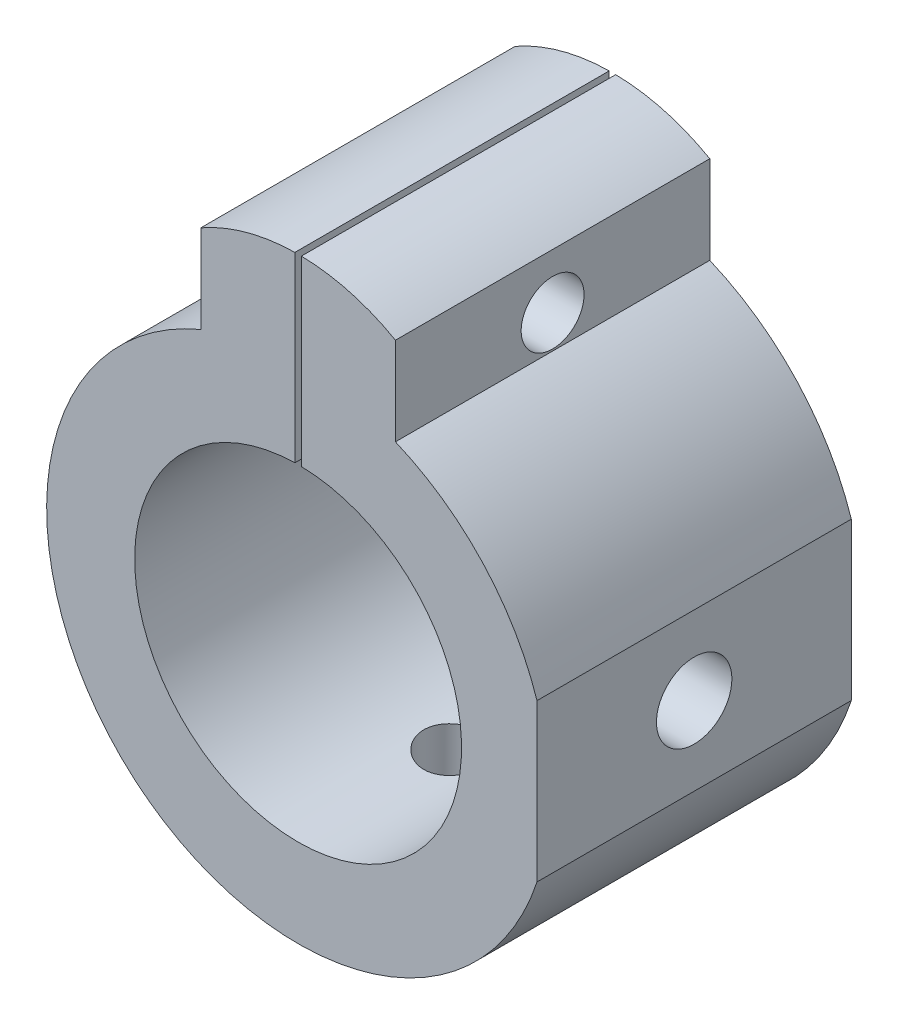
ISO-10303-21;
HEADER;
FILE_DESCRIPTION(('STEP AP214'),'2;1');
FILE_NAME('part.step','',(''),(''),'','','');
FILE_SCHEMA(('AUTOMOTIVE_DESIGN { 1 0 10303 214 1 1 1 1 }'));
ENDSEC;
DATA;
#1=APPLICATION_CONTEXT('core data for automotive mechanical design processes');
#2=APPLICATION_PROTOCOL_DEFINITION('international standard','automotive_design',2000,#1);
#3=PRODUCT_CONTEXT('',#1,'mechanical');
#4=PRODUCT('Part','Part','',(#3));
#5=PRODUCT_RELATED_PRODUCT_CATEGORY('part','',(#4));
#6=PRODUCT_DEFINITION_FORMATION('','',#4);
#7=PRODUCT_DEFINITION_CONTEXT('part definition',#1,'design');
#8=PRODUCT_DEFINITION('design','',#6,#7);
#9=PRODUCT_DEFINITION_SHAPE('','',#8);
#10=(LENGTH_UNIT() NAMED_UNIT(*) SI_UNIT(.MILLI.,.METRE.));
#11=(NAMED_UNIT(*) PLANE_ANGLE_UNIT() SI_UNIT($,.RADIAN.));
#12=(NAMED_UNIT(*) SI_UNIT($,.STERADIAN.) SOLID_ANGLE_UNIT());
#13=UNCERTAINTY_MEASURE_WITH_UNIT(LENGTH_MEASURE(1.E-05),#10,'distance_accuracy_value','');
#14=(GEOMETRIC_REPRESENTATION_CONTEXT(3) GLOBAL_UNCERTAINTY_ASSIGNED_CONTEXT((#13)) GLOBAL_UNIT_ASSIGNED_CONTEXT((#10,
#11,#12)) REPRESENTATION_CONTEXT('',''));
#15=CARTESIAN_POINT('',(0.,0.,0.));
#16=DIRECTION('',(0.,0.,1.));
#17=DIRECTION('',(1.,0.,0.));
#18=AXIS2_PLACEMENT_3D('',#15,#16,#17);
#19=CARTESIAN_POINT('',(0.,0.,10.));
#20=DIRECTION('',(0.,0.,-1.));
#21=DIRECTION('',(-1.,0.,0.));
#22=AXIS2_PLACEMENT_3D('',#19,#20,#21);
#23=CYLINDRICAL_SURFACE('',#22,20.);
#24=CARTESIAN_POINT('',(0.,-20.,15.));
#25=CARTESIAN_POINT('',(0.139841095555761,-19.9999980489643,14.9999940590643));
#26=CARTESIAN_POINT('',(0.279769574302747,-19.998517845549,14.9882271208307));
#27=CARTESIAN_POINT('',(0.555732802089753,-19.9927554011136,14.9414722454292));
#28=CARTESIAN_POINT('',(0.691763330623745,-19.9884702344143,14.9064600620766));
#29=CARTESIAN_POINT('',(0.955895574813054,-19.9775806104441,14.8142623560859));
#30=CARTESIAN_POINT('',(1.08400256014614,-19.9709777145554,14.7570917581901));
#31=CARTESIAN_POINT('',(1.32877947489304,-19.956187008781,14.6222327160302));
#32=CARTESIAN_POINT('',(1.44545136155637,-19.9479994708412,14.5445477914693));
#33=CARTESIAN_POINT('',(1.66471281693132,-19.9309032130633,14.3704080501604));
#34=CARTESIAN_POINT('',(1.76723036493713,-19.9219911469242,14.2738628706538));
#35=CARTESIAN_POINT('',(1.95465279355749,-19.9044772600975,14.0649371764634));
#36=CARTESIAN_POINT('',(2.03955677639225,-19.8958754552427,13.9525558550868));
#37=CARTESIAN_POINT('',(2.18961016128394,-19.8799230561959,13.7146800224343));
#38=CARTESIAN_POINT('',(2.25469209594107,-19.8725767717791,13.5891426384321));
#39=CARTESIAN_POINT('',(2.36282307657512,-19.8600112845768,13.3288129480526));
#40=CARTESIAN_POINT('',(2.40587295806522,-19.8547920011314,13.194020992853));
#41=CARTESIAN_POINT('',(2.46849898002476,-19.8471033960361,12.9197558044132));
#42=CARTESIAN_POINT('',(2.4881967147317,-19.8446198343675,12.7803107422958));
#43=CARTESIAN_POINT('',(2.50393554955723,-19.8426402814279,12.5000737365282));
#44=CARTESIAN_POINT('',(2.49997760100242,-19.8431441700151,12.3592818472687));
#45=CARTESIAN_POINT('',(2.4686172364479,-19.8470695536975,12.0811951727512));
#46=CARTESIAN_POINT('',(2.4413487629847,-19.8504743796033,11.9438850137997));
#47=CARTESIAN_POINT('',(2.36435038318205,-19.8597919975763,11.675804978781));
#48=CARTESIAN_POINT('',(2.3146200217519,-19.8657048404572,11.545035235286));
#49=CARTESIAN_POINT('',(2.19396555991165,-19.8793911586465,11.2933320009783));
#50=CARTESIAN_POINT('',(2.12298325370764,-19.8871697321144,11.172426699751));
#51=CARTESIAN_POINT('',(1.96188146945692,-19.903707114306,10.9441933055868));
#52=CARTESIAN_POINT('',(1.87176111608078,-19.9124659678566,10.8368658340263));
#53=CARTESIAN_POINT('',(1.67419911075378,-19.9300510989043,10.6380572892773));
#54=CARTESIAN_POINT('',(1.56664200784001,-19.9388774238689,10.546690908234));
#55=CARTESIAN_POINT('',(1.33765716911392,-19.9555463255585,10.3832911199695));
#56=CARTESIAN_POINT('',(1.21622940131825,-19.9633889000151,10.311257757328));
#57=CARTESIAN_POINT('',(0.962861671363482,-19.9772115221858,10.1885686795361));
#58=CARTESIAN_POINT('',(0.830918195337717,-19.9831909440154,10.1379201461188));
#59=CARTESIAN_POINT('',(0.560307940431056,-19.9926078578006,10.0595295064767));
#60=CARTESIAN_POINT('',(0.421641476630668,-19.9960454687587,10.031786327863));
#61=CARTESIAN_POINT('',(0.142513163913498,-19.9999759641076,10.0001425757394));
#62=CARTESIAN_POINT('',(0.0020694901986081,-20.0004883614264,9.99608400763593));
#63=CARTESIAN_POINT('',(-0.277496036497495,-19.9985633800543,10.011507734056));
#64=CARTESIAN_POINT('',(-0.416617917564706,-19.9961260641821,10.0309895272516));
#65=CARTESIAN_POINT('',(-0.689124507721521,-19.9885876875669,10.0928097087744));
#66=CARTESIAN_POINT('',(-0.822526570424704,-19.9834954081387,10.1350727634026));
#67=CARTESIAN_POINT('',(-1.08034965485841,-19.971217231002,10.2411774519129));
#68=CARTESIAN_POINT('',(-1.20477037146531,-19.9640312622062,10.3050198184914));
#69=CARTESIAN_POINT('',(-1.44180452068743,-19.9483182291011,10.4528531375075));
#70=CARTESIAN_POINT('',(-1.55435375994382,-19.9397844404251,10.5369462898056));
#71=CARTESIAN_POINT('',(-1.76379698962632,-19.9223514232566,10.7227494975342));
#72=CARTESIAN_POINT('',(-1.86069035833686,-19.913452180269,10.824460252251));
#73=CARTESIAN_POINT('',(-2.03663195881802,-19.8962310546258,11.0433074167571));
#74=CARTESIAN_POINT('',(-2.11557546056793,-19.8879127472133,11.1605283463104));
#75=CARTESIAN_POINT('',(-2.25265288944351,-19.8728541103715,11.4066582448547));
#76=CARTESIAN_POINT('',(-2.31078723372837,-19.8661137493103,11.5355669794765));
#77=CARTESIAN_POINT('',(-2.40442657886654,-19.85499850393,11.8010753191476));
#78=CARTESIAN_POINT('',(-2.43999062745711,-19.8506174518479,11.937653830048));
#79=CARTESIAN_POINT('',(-2.48766999386785,-19.8446991590746,12.2149024837807));
#80=CARTESIAN_POINT('',(-2.49978640253576,-19.8431617860878,12.355572435959));
#81=CARTESIAN_POINT('',(-2.50020653608484,-19.8431087698246,12.6359689292047));
#82=CARTESIAN_POINT('',(-2.48867479769927,-19.8445722475195,12.7756952483319));
#83=CARTESIAN_POINT('',(-2.44247440484933,-19.850311145372,13.0512071293451));
#84=CARTESIAN_POINT('',(-2.40780574790577,-19.8545865658308,13.1869926908088));
#85=CARTESIAN_POINT('',(-2.31636707368966,-19.8654611577455,13.4507469567664));
#86=CARTESIAN_POINT('',(-2.25960498097093,-19.8720594959278,13.5787184450218));
#87=CARTESIAN_POINT('',(-2.12560690215031,-19.8868378324482,13.8233466540483));
#88=CARTESIAN_POINT('',(-2.04837065950959,-19.8950178506041,13.9400032330198));
#89=CARTESIAN_POINT('',(-1.87500633126584,-19.9121060475223,14.1595312253405));
#90=CARTESIAN_POINT('',(-1.77875562577496,-19.9210187208403,14.262305460955));
#91=CARTESIAN_POINT('',(-1.57035022696838,-19.938528315929,14.450306825168));
#92=CARTESIAN_POINT('',(-1.45819178914157,-19.9471251627559,14.5355298107743));
#93=CARTESIAN_POINT('',(-1.22066562085421,-19.9630705658675,14.6862853571053));
#94=CARTESIAN_POINT('',(-1.09524927959617,-19.970414250783,14.7517418058993));
#95=CARTESIAN_POINT('',(-0.83518290230128,-19.9829764907673,14.8605712429163));
#96=CARTESIAN_POINT('',(-0.700543080870235,-19.9881973536958,14.9039682263535));
#97=CARTESIAN_POINT('',(-0.471005771967923,-19.9946672032775,14.9570593381713));
#98=CARTESIAN_POINT('',(-0.377555663516919,-19.9966572589545,14.9731389419821));
#99=CARTESIAN_POINT('',(-0.189417063212434,-19.9993243132919,14.9946112456932));
#100=CARTESIAN_POINT('',(-0.0947285804960267,-20.0000013216347,15.0000040243993));
#101=CARTESIAN_POINT('',(0.,-20.,15.));
#102=B_SPLINE_CURVE_WITH_KNOTS('',3,(#24,#25,#26,#27,#28,#29,#30,#31,#32,#33,#34,#35,#36,#37,
#38,#39,#40,#41,#42,#43,#44,#45,#46,#47,#48,#49,#50,#51,#52,#53,#54,#55,#56,#57,#58,#59,#60,#61,
#62,#63,#64,#65,#66,#67,#68,#69,#70,#71,#72,#73,#74,#75,#76,#77,#78,#79,#80,#81,#82,#83,#84,#85,
#86,#87,#88,#89,#90,#91,#92,#93,#94,#95,#96,#97,#98,#99,#100,#101),.UNSPECIFIED.,.T.,.F.,(4,2,2,
2,2,2,2,2,2,2,2,2,2,2,2,2,2,2,2,2,2,2,2,2,2,2,2,2,2,2,2,2,2,2,2,2,2,2,4),(0.,0.419177272776247,
0.838792460943427,1.25812550818177,1.67738665591073,2.09870813201843,2.52005107800011,
2.9428125031887,3.36555789496807,3.78609225286321,4.20660969884664,4.62472696441692,
5.04285270166241,5.46213426285534,5.88143500513639,6.30363478136417,6.72583553113113,
7.14817795731605,7.5705006090378,7.99000279391921,8.40949604501929,8.82761053893396,
9.24573923078948,9.66602402928422,10.0863255137509,10.5090197150757,10.9317054422154,
11.3532807428093,11.7748364301062,12.1934690120221,12.6121016387955,13.0305842470649,
13.4490720991226,13.8703523769183,14.2917319847001,14.7147140303685,15.1372349868403,
15.4211884318763,15.7051397830044),.UNSPECIFIED.);
#103=CARTESIAN_POINT('',(0.,-20.,15.));
#104=VERTEX_POINT('',#103);
#105=EDGE_CURVE('E165',#104,#104,#102,.T.);
#106=ORIENTED_EDGE('',*,*,#105,.T.);
#107=EDGE_LOOP('',(#106));
#108=FACE_BOUND('',#107,.T.);
#109=DIRECTION('',(0.,0.,-1.));
#110=VECTOR('',#109,1.);
#111=CARTESIAN_POINT('',(19.,-6.24499799839841,10.));
#112=LINE('',#111,#110);
#113=CARTESIAN_POINT('',(19.,-6.24499799839841,25.));
#114=VERTEX_POINT('',#113);
#115=CARTESIAN_POINT('',(19.,-6.24499799839841,0.));
#116=VERTEX_POINT('',#115);
#117=EDGE_CURVE('E166',#114,#116,#112,.T.);
#118=ORIENTED_EDGE('',*,*,#117,.F.);
#119=CARTESIAN_POINT('',(0.,0.,25.));
#120=DIRECTION('',(0.,0.,1.));
#121=DIRECTION('',(1.,0.,0.));
#122=AXIS2_PLACEMENT_3D('',#119,#120,#121);
#123=CIRCLE('',#122,20.);
#124=CARTESIAN_POINT('',(-7.74027571439312,18.441478570472,25.));
#125=VERTEX_POINT('',#124);
#126=EDGE_CURVE('E251',#125,#114,#123,.T.);
#127=ORIENTED_EDGE('',*,*,#126,.F.);
#128=DIRECTION('',(0.,0.,-1.));
#129=VECTOR('',#128,1.);
#130=CARTESIAN_POINT('',(-7.74027571439312,18.441478570472,10.));
#131=LINE('',#130,#129);
#132=CARTESIAN_POINT('',(-7.74027571439312,18.441478570472,0.));
#133=VERTEX_POINT('',#132);
#134=EDGE_CURVE('E131',#125,#133,#131,.T.);
#135=ORIENTED_EDGE('',*,*,#134,.T.);
#136=CARTESIAN_POINT('',(0.,0.,0.));
#137=DIRECTION('',(0.,0.,1.));
#138=DIRECTION('',(1.,0.,0.));
#139=AXIS2_PLACEMENT_3D('',#136,#137,#138);
#140=CIRCLE('',#139,20.);
#141=EDGE_CURVE('E145',#133,#116,#140,.T.);
#142=ORIENTED_EDGE('',*,*,#141,.T.);
#143=EDGE_LOOP('',(#118,#127,#135,#142));
#144=FACE_BOUND('',#143,.T.);
#145=ADVANCED_FACE('F38',(#108,#144),#23,.T.);
#146=DIRECTION('',(0.,0.,-1.));
#147=VECTOR('',#146,1.);
#148=CARTESIAN_POINT('',(19.,6.24499799839841,10.));
#149=LINE('',#148,#147);
#150=CARTESIAN_POINT('',(19.,6.24499799839841,0.));
#151=VERTEX_POINT('',#150);
#152=CARTESIAN_POINT('',(19.,6.24499799839841,25.));
#153=VERTEX_POINT('',#152);
#154=EDGE_CURVE('E53',#151,#153,#149,.F.);
#155=ORIENTED_EDGE('',*,*,#154,.F.);
#156=CARTESIAN_POINT('',(7.74027571439312,18.441478570472,0.));
#157=VERTEX_POINT('',#156);
#158=EDGE_CURVE('E77',#151,#157,#140,.T.);
#159=ORIENTED_EDGE('',*,*,#158,.T.);
#160=DIRECTION('',(0.,0.,-1.));
#161=VECTOR('',#160,1.);
#162=CARTESIAN_POINT('',(7.74027571439312,18.441478570472,10.));
#163=LINE('',#162,#161);
#164=CARTESIAN_POINT('',(7.74027571439312,18.441478570472,25.));
#165=VERTEX_POINT('',#164);
#166=EDGE_CURVE('E156',#165,#157,#163,.T.);
#167=ORIENTED_EDGE('',*,*,#166,.F.);
#168=EDGE_CURVE('E275',#153,#165,#123,.T.);
#169=ORIENTED_EDGE('',*,*,#168,.F.);
#170=EDGE_LOOP('',(#155,#159,#167,#169));
#171=FACE_BOUND('',#170,.T.);
#172=ADVANCED_FACE('F194',(#171),#23,.T.);
#173=CARTESIAN_POINT('',(0.,0.,0.));
#174=DIRECTION('',(0.,0.,1.));
#175=DIRECTION('',(1.,0.,0.));
#176=AXIS2_PLACEMENT_3D('',#173,#174,#175);
#177=PLANE('',#176);
#178=DIRECTION('',(0.,-1.,0.));
#179=VECTOR('',#178,1.);
#180=CARTESIAN_POINT('',(19.,15.,0.));
#181=LINE('',#180,#179);
#182=EDGE_CURVE('E347',#151,#116,#181,.T.);
#183=ORIENTED_EDGE('',*,*,#182,.T.);
#184=ORIENTED_EDGE('',*,*,#141,.F.);
#185=DIRECTION('',(0.,1.,0.));
#186=VECTOR('',#185,1.);
#187=CARTESIAN_POINT('',(-7.74027571439312,0.,0.));
#188=LINE('',#187,#186);
#189=CARTESIAN_POINT('',(-7.74027571439312,25.441478570472,0.));
#190=VERTEX_POINT('',#189);
#191=EDGE_CURVE('E125',#133,#190,#188,.T.);
#192=ORIENTED_EDGE('',*,*,#191,.T.);
#193=CARTESIAN_POINT('',(0.,11.87489743787,0.));
#194=DIRECTION('',(0.,0.,1.));
#195=DIRECTION('',(1.,0.,0.));
#196=AXIS2_PLACEMENT_3D('',#193,#194,#195);
#197=CIRCLE('',#196,15.6193467136848);
#198=CARTESIAN_POINT('',(-0.258597553957538,27.4921033040735,0.));
#199=VERTEX_POINT('',#198);
#200=EDGE_CURVE('E135',#190,#199,#197,.F.);
#201=ORIENTED_EDGE('',*,*,#200,.T.);
#202=DIRECTION('',(0.,-1.,0.));
#203=VECTOR('',#202,1.);
#204=CARTESIAN_POINT('',(-0.258597553957538,0.,0.));
#205=LINE('',#204,#203);
#206=CARTESIAN_POINT('',(-0.258597553957538,12.9974277187868,0.));
#207=VERTEX_POINT('',#206);
#208=EDGE_CURVE('E238',#199,#207,#205,.T.);
#209=ORIENTED_EDGE('',*,*,#208,.T.);
#210=CARTESIAN_POINT('',(0.,0.,0.));
#211=DIRECTION('',(0.,0.,1.));
#212=DIRECTION('',(1.,0.,0.));
#213=AXIS2_PLACEMENT_3D('',#210,#211,#212);
#214=CIRCLE('',#213,13.);
#215=CARTESIAN_POINT('',(0.258597553957538,12.9974277187868,0.));
#216=VERTEX_POINT('',#215);
#217=EDGE_CURVE('E152',#207,#216,#214,.T.);
#218=ORIENTED_EDGE('',*,*,#217,.T.);
#219=DIRECTION('',(0.,1.,0.));
#220=VECTOR('',#219,1.);
#221=CARTESIAN_POINT('',(0.258597553957538,0.,0.));
#222=LINE('',#221,#220);
#223=CARTESIAN_POINT('',(0.258597553957538,27.4921033040735,0.));
#224=VERTEX_POINT('',#223);
#225=EDGE_CURVE('E271',#216,#224,#222,.T.);
#226=ORIENTED_EDGE('',*,*,#225,.T.);
#227=CARTESIAN_POINT('',(7.74027571439312,25.441478570472,0.));
#228=VERTEX_POINT('',#227);
#229=EDGE_CURVE('E140',#224,#228,#197,.F.);
#230=ORIENTED_EDGE('',*,*,#229,.T.);
#231=DIRECTION('',(0.,1.,0.));
#232=VECTOR('',#231,1.);
#233=CARTESIAN_POINT('',(7.74027571439312,0.,0.));
#234=LINE('',#233,#232);
#235=EDGE_CURVE('E153',#157,#228,#234,.T.);
#236=ORIENTED_EDGE('',*,*,#235,.F.);
#237=ORIENTED_EDGE('',*,*,#158,.F.);
#238=EDGE_LOOP('',(#183,#184,#192,#201,#209,#218,#226,#230,#236,#237));
#239=FACE_BOUND('',#238,.T.);
#240=ADVANCED_FACE('F143',(#239),#177,.F.);
#241=CARTESIAN_POINT('',(0.,0.,25.));
#242=DIRECTION('',(0.,0.,1.));
#243=DIRECTION('',(1.,0.,0.));
#244=AXIS2_PLACEMENT_3D('',#241,#242,#243);
#245=PLANE('',#244);
#246=ORIENTED_EDGE('',*,*,#126,.T.);
#247=DIRECTION('',(0.,1.,0.));
#248=VECTOR('',#247,1.);
#249=CARTESIAN_POINT('',(19.,0.,25.));
#250=LINE('',#249,#248);
#251=EDGE_CURVE('E11',#114,#153,#250,.T.);
#252=ORIENTED_EDGE('',*,*,#251,.T.);
#253=ORIENTED_EDGE('',*,*,#168,.T.);
#254=DIRECTION('',(0.,1.,0.));
#255=VECTOR('',#254,1.);
#256=CARTESIAN_POINT('',(7.74027571439312,18.441478570472,25.));
#257=LINE('',#256,#255);
#258=CARTESIAN_POINT('',(7.74027571439312,25.441478570472,25.));
#259=VERTEX_POINT('',#258);
#260=EDGE_CURVE('E247',#165,#259,#257,.T.);
#261=ORIENTED_EDGE('',*,*,#260,.T.);
#262=CARTESIAN_POINT('',(0.,11.8748974378699,25.));
#263=DIRECTION('',(0.,0.,1.));
#264=DIRECTION('',(-1.,0.,0.));
#265=AXIS2_PLACEMENT_3D('',#262,#263,#264);
#266=CIRCLE('',#265,15.6193467136848);
#267=CARTESIAN_POINT('',(0.258597553957538,27.4921033040735,25.));
#268=VERTEX_POINT('',#267);
#269=EDGE_CURVE('E246',#259,#268,#266,.T.);
#270=ORIENTED_EDGE('',*,*,#269,.T.);
#271=DIRECTION('',(0.,1.,0.));
#272=VECTOR('',#271,1.);
#273=CARTESIAN_POINT('',(0.258597553957538,0.,25.));
#274=LINE('',#273,#272);
#275=CARTESIAN_POINT('',(0.258597553957538,12.9974277187868,25.));
#276=VERTEX_POINT('',#275);
#277=EDGE_CURVE('E158',#276,#268,#274,.T.);
#278=ORIENTED_EDGE('',*,*,#277,.F.);
#279=CARTESIAN_POINT('',(0.,0.,25.));
#280=DIRECTION('',(0.,0.,1.));
#281=DIRECTION('',(1.,0.,0.));
#282=AXIS2_PLACEMENT_3D('',#279,#280,#281);
#283=CIRCLE('',#282,13.);
#284=CARTESIAN_POINT('',(-0.258597553957538,12.9974277187868,25.));
#285=VERTEX_POINT('',#284);
#286=EDGE_CURVE('E239',#285,#276,#283,.T.);
#287=ORIENTED_EDGE('',*,*,#286,.F.);
#288=DIRECTION('',(0.,-1.,0.));
#289=VECTOR('',#288,1.);
#290=CARTESIAN_POINT('',(-0.258597553957538,0.,25.));
#291=LINE('',#290,#289);
#292=CARTESIAN_POINT('',(-0.258597553957538,27.4921033040735,25.));
#293=VERTEX_POINT('',#292);
#294=EDGE_CURVE('E46',#293,#285,#291,.T.);
#295=ORIENTED_EDGE('',*,*,#294,.F.);
#296=CARTESIAN_POINT('',(-7.74027571439312,25.441478570472,25.));
#297=VERTEX_POINT('',#296);
#298=EDGE_CURVE('E243',#293,#297,#266,.T.);
#299=ORIENTED_EDGE('',*,*,#298,.T.);
#300=DIRECTION('',(0.,-1.,0.));
#301=VECTOR('',#300,1.);
#302=CARTESIAN_POINT('',(-7.74027571439312,18.441478570472,25.));
#303=LINE('',#302,#301);
#304=EDGE_CURVE('E127',#297,#125,#303,.T.);
#305=ORIENTED_EDGE('',*,*,#304,.T.);
#306=EDGE_LOOP('',(#246,#252,#253,#261,#270,#278,#287,#295,#299,#305));
#307=FACE_BOUND('',#306,.T.);
#308=ADVANCED_FACE('F209',(#307),#245,.T.);
#309=CARTESIAN_POINT('',(0.,11.87489743787,10.));
#310=DIRECTION('',(0.,0.,-1.));
#311=DIRECTION('',(-1.,0.,0.));
#312=AXIS2_PLACEMENT_3D('',#309,#310,#311);
#313=CYLINDRICAL_SURFACE('',#312,15.6193467136848);
#314=DIRECTION('',(0.,0.,-1.));
#315=VECTOR('',#314,1.);
#316=CARTESIAN_POINT('',(-0.258597553957538,27.4921033040735,10.));
#317=LINE('',#316,#315);
#318=EDGE_CURVE('E137',#199,#293,#317,.F.);
#319=ORIENTED_EDGE('',*,*,#318,.F.);
#320=ORIENTED_EDGE('',*,*,#200,.F.);
#321=DIRECTION('',(0.,0.,-1.));
#322=VECTOR('',#321,1.);
#323=CARTESIAN_POINT('',(-7.74027571439312,25.441478570472,10.));
#324=LINE('',#323,#322);
#325=EDGE_CURVE('E121',#297,#190,#324,.T.);
#326=ORIENTED_EDGE('',*,*,#325,.F.);
#327=ORIENTED_EDGE('',*,*,#298,.F.);
#328=EDGE_LOOP('',(#319,#320,#326,#327));
#329=FACE_BOUND('',#328,.T.);
#330=ADVANCED_FACE('F136',(#329),#313,.T.);
#331=CARTESIAN_POINT('',(7.74027571439312,0.,10.));
#332=DIRECTION('',(-1.,0.,0.));
#333=DIRECTION('',(0.,0.,1.));
#334=AXIS2_PLACEMENT_3D('',#331,#332,#333);
#335=PLANE('',#334);
#336=CARTESIAN_POINT('',(7.74027571439312,21.0864235760214,12.5));
#337=DIRECTION('',(1.,0.,0.));
#338=DIRECTION('',(0.,0.,-1.));
#339=AXIS2_PLACEMENT_3D('',#336,#337,#338);
#340=CIRCLE('',#339,2.5);
#341=CARTESIAN_POINT('',(7.74027571439312,21.0864235760214,10.));
#342=VERTEX_POINT('',#341);
#343=EDGE_CURVE('E188',#342,#342,#340,.T.);
#344=ORIENTED_EDGE('',*,*,#343,.F.);
#345=EDGE_LOOP('',(#344));
#346=FACE_BOUND('',#345,.T.);
#347=ORIENTED_EDGE('',*,*,#235,.T.);
#348=DIRECTION('',(0.,0.,-1.));
#349=VECTOR('',#348,1.);
#350=CARTESIAN_POINT('',(7.74027571439312,25.441478570472,10.));
#351=LINE('',#350,#349);
#352=EDGE_CURVE('E130',#259,#228,#351,.T.);
#353=ORIENTED_EDGE('',*,*,#352,.F.);
#354=ORIENTED_EDGE('',*,*,#260,.F.);
#355=ORIENTED_EDGE('',*,*,#166,.T.);
#356=EDGE_LOOP('',(#347,#353,#354,#355));
#357=FACE_BOUND('',#356,.T.);
#358=ADVANCED_FACE('F40',(#346,#357),#335,.F.);
#359=DIRECTION('',(0.,0.,-1.));
#360=VECTOR('',#359,1.);
#361=CARTESIAN_POINT('',(0.258597553957538,27.4921033040735,10.));
#362=LINE('',#361,#360);
#363=EDGE_CURVE('E273',#268,#224,#362,.T.);
#364=ORIENTED_EDGE('',*,*,#363,.F.);
#365=ORIENTED_EDGE('',*,*,#269,.F.);
#366=ORIENTED_EDGE('',*,*,#352,.T.);
#367=ORIENTED_EDGE('',*,*,#229,.F.);
#368=EDGE_LOOP('',(#364,#365,#366,#367));
#369=FACE_BOUND('',#368,.T.);
#370=ADVANCED_FACE('F197',(#369),#313,.T.);
#371=CARTESIAN_POINT('',(-7.74027571439312,0.,10.));
#372=DIRECTION('',(-1.,0.,0.));
#373=DIRECTION('',(0.,0.,1.));
#374=AXIS2_PLACEMENT_3D('',#371,#372,#373);
#375=PLANE('',#374);
#376=CARTESIAN_POINT('',(-7.74027571439312,21.0864235760214,12.5));
#377=DIRECTION('',(-1.,0.,0.));
#378=DIRECTION('',(0.,0.,1.));
#379=AXIS2_PLACEMENT_3D('',#376,#377,#378);
#380=CIRCLE('',#379,2.5);
#381=CARTESIAN_POINT('',(-7.74027571439312,21.0864235760214,15.));
#382=VERTEX_POINT('',#381);
#383=EDGE_CURVE('E262',#382,#382,#380,.T.);
#384=ORIENTED_EDGE('',*,*,#383,.F.);
#385=EDGE_LOOP('',(#384));
#386=FACE_BOUND('',#385,.T.);
#387=ORIENTED_EDGE('',*,*,#191,.F.);
#388=ORIENTED_EDGE('',*,*,#134,.F.);
#389=ORIENTED_EDGE('',*,*,#304,.F.);
#390=ORIENTED_EDGE('',*,*,#325,.T.);
#391=EDGE_LOOP('',(#387,#388,#389,#390));
#392=FACE_BOUND('',#391,.T.);
#393=ADVANCED_FACE('F123',(#386,#392),#375,.T.);
#394=CARTESIAN_POINT('',(0.,0.,10.));
#395=DIRECTION('',(0.,0.,-1.));
#396=DIRECTION('',(-1.,0.,0.));
#397=AXIS2_PLACEMENT_3D('',#394,#395,#396);
#398=CYLINDRICAL_SURFACE('',#397,13.);
#399=CARTESIAN_POINT('',(13.,0.,9.5));
#400=CARTESIAN_POINT('',(12.9999969906573,-0.166152344952669,9.50000533071178));
#401=CARTESIAN_POINT('',(12.9967824842909,-0.332367205973654,9.51384985362219));
#402=CARTESIAN_POINT('',(12.9842700075106,-0.660059866493254,9.5687952857713));
#403=CARTESIAN_POINT('',(12.9749680237034,-0.821534467366725,9.60991417688281));
#404=CARTESIAN_POINT('',(12.9513142129353,-1.13496480129888,9.71803939788185));
#405=CARTESIAN_POINT('',(12.936967958219,-1.28693082086391,9.78501717026269));
#406=CARTESIAN_POINT('',(12.904766336637,-1.577465910561,9.94286453013674));
#407=CARTESIAN_POINT('',(12.8869109815535,-1.71603502567188,10.0337340374119));
#408=CARTESIAN_POINT('',(12.8492864660987,-1.97830470624641,10.2384905033544));
#409=CARTESIAN_POINT('',(12.8294913730764,-2.10173358432239,10.3527207234048));
#410=CARTESIAN_POINT('',(12.7903971901517,-2.32786120795392,10.6002198531428));
#411=CARTESIAN_POINT('',(12.7710981487534,-2.43055793299827,10.7334906163216));
#412=CARTESIAN_POINT('',(12.7349234835873,-2.61353391505111,11.01733385512));
#413=CARTESIAN_POINT('',(12.7180809816988,-2.69351850955545,11.1681008819513));
#414=CARTESIAN_POINT('',(12.6891009206901,-2.82690790660153,11.4813901973035));
#415=CARTESIAN_POINT('',(12.6769627300499,-2.88031627708408,11.6439109044991));
#416=CARTESIAN_POINT('',(12.659030692131,-2.95812848517193,11.9731316031644));
#417=CARTESIAN_POINT('',(12.6531311408672,-2.98301618993589,12.1397113467331));
#418=CARTESIAN_POINT('',(12.6480272975283,-3.00458614092873,12.4747781740707));
#419=CARTESIAN_POINT('',(12.6488220853967,-3.00127226312641,12.6432649925563));
#420=CARTESIAN_POINT('',(12.6569216667427,-2.96692126571465,12.9737256156487));
#421=CARTESIAN_POINT('',(12.6640932250769,-2.93645150630372,13.1357621626882));
#422=CARTESIAN_POINT('',(12.683927027642,-2.8495548295868,13.4523595838029));
#423=CARTESIAN_POINT('',(12.6965896109567,-2.79312630925337,13.6069199955541));
#424=CARTESIAN_POINT('',(12.726106644567,-2.65540698150097,13.9057453432819));
#425=CARTESIAN_POINT('',(12.7429968648251,-2.57390258493056,14.049908161822));
#426=CARTESIAN_POINT('',(12.7790447936328,-2.3884949795051,14.3227184725787));
#427=CARTESIAN_POINT('',(12.7982028439228,-2.28458839291061,14.451363620518));
#428=CARTESIAN_POINT('',(12.8371955528176,-2.05434642172905,14.692747900102));
#429=CARTESIAN_POINT('',(12.8570353769547,-1.92752990169011,14.8050277702499));
#430=CARTESIAN_POINT('',(12.8947363213875,-1.65663728210681,15.0068061419507));
#431=CARTESIAN_POINT('',(12.91259739752,-1.51256079749006,15.0963041350972));
#432=CARTESIAN_POINT('',(12.94439708166,-1.21064255594474,15.2501118282866));
#433=CARTESIAN_POINT('',(12.9583254640484,-1.0527662865885,15.3143560313853));
#434=CARTESIAN_POINT('',(12.980615159728,-0.728064792505165,15.4152722873901));
#435=CARTESIAN_POINT('',(12.9889773764326,-0.561241024748475,15.4519488147769));
#436=CARTESIAN_POINT('',(12.999062058904,-0.22731464786328,15.4960083006963));
#437=CARTESIAN_POINT('',(13.0009265305377,-0.0602988900254587,15.5040178721195));
#438=CARTESIAN_POINT('',(12.9982059982626,0.272684743158448,15.4922219704814));
#439=CARTESIAN_POINT('',(12.9936214841662,0.438652697125491,15.472418609864));
#440=CARTESIAN_POINT('',(12.9786082469926,0.762715807596044,15.4060776067885));
#441=CARTESIAN_POINT('',(12.968252478837,0.920882929751392,15.3598735173657));
#442=CARTESIAN_POINT('',(12.9428582085761,1.22721924496333,15.2424168221512));
#443=CARTESIAN_POINT('',(12.9278192778858,1.3753875214532,15.1711619237282));
#444=CARTESIAN_POINT('',(12.8943799217624,1.66007523022035,15.0043547121581));
#445=CARTESIAN_POINT('',(12.8759307059183,1.79637682059256,14.9084406162299));
#446=CARTESIAN_POINT('',(12.8378078382851,2.05117436096366,14.6955087652826));
#447=CARTESIAN_POINT('',(12.8181340084537,2.16966771329558,14.5784879369158));
#448=CARTESIAN_POINT('',(12.7792809496474,2.38800205666,14.3237752282431));
#449=CARTESIAN_POINT('',(12.7601203499969,2.48740687177955,14.1857060706494));
#450=CARTESIAN_POINT('',(12.7249237700036,2.66162470892946,13.8944682395653));
#451=CARTESIAN_POINT('',(12.7088876507294,2.73643882449717,13.7413002379075));
#452=CARTESIAN_POINT('',(12.6819190230073,2.85882133736006,13.4250480231647));
#453=CARTESIAN_POINT('',(12.6709569224205,2.90654808960746,13.262027740679));
#454=CARTESIAN_POINT('',(12.6553320099168,2.9738506135118,12.9299920143535));
#455=CARTESIAN_POINT('',(12.6506680575041,2.99343148198756,12.7609776616361));
#456=CARTESIAN_POINT('',(12.6482450687886,3.00365072031913,12.4261635458855));
#457=CARTESIAN_POINT('',(12.6503205850391,2.99498255743034,12.2603857787004));
#458=CARTESIAN_POINT('',(12.6607654071459,2.95051371961671,11.9327226426661));
#459=CARTESIAN_POINT('',(12.6691346207273,2.91471344248812,11.7708372167854));
#460=CARTESIAN_POINT('',(12.6911387833219,2.81734841440311,11.4561801784171));
#461=CARTESIAN_POINT('',(12.7047508718617,2.7558954206715,11.3033722785881));
#462=CARTESIAN_POINT('',(12.7357136622437,2.60906164454194,11.0101363869175));
#463=CARTESIAN_POINT('',(12.7530648031611,2.52367805163026,10.8697098517453));
#464=CARTESIAN_POINT('',(12.7900365874876,2.32915359032528,10.6018289428198));
#465=CARTESIAN_POINT('',(12.8096993736488,2.21952324066575,10.4747357609008));
#466=CARTESIAN_POINT('',(12.8488080487622,1.98059542918642,10.2405235047234));
#467=CARTESIAN_POINT('',(12.8682538861233,1.85129339204876,10.1334090901394));
#468=CARTESIAN_POINT('',(12.9050799859908,1.57438386552311,9.94066546410237));
#469=CARTESIAN_POINT('',(12.9224254113505,1.42653373816977,9.85537776342045));
#470=CARTESIAN_POINT('',(12.9527409110575,1.11821928295074,9.71100170118278));
#471=CARTESIAN_POINT('',(12.9657144587282,0.95776509420387,9.65189252979414));
#472=CARTESIAN_POINT('',(12.9836544679345,0.664420748397536,9.57144305288853));
#473=CARTESIAN_POINT('',(12.989744579336,0.533052734642018,9.544705457946));
#474=CARTESIAN_POINT('',(12.9979184490222,0.267803260561671,9.50898226677057));
#475=CARTESIAN_POINT('',(13.0000024255872,0.133921937579662,9.49999570334532));
#476=CARTESIAN_POINT('',(13.,0.,9.5));
#477=B_SPLINE_CURVE_WITH_KNOTS('',3,(#399,#400,#401,#402,#403,#404,#405,#406,#407,#408,#409,
#410,#411,#412,#413,#414,#415,#416,#417,#418,#419,#420,#421,#422,#423,#424,#425,#426,#427,#428,
#429,#430,#431,#432,#433,#434,#435,#436,#437,#438,#439,#440,#441,#442,#443,#444,#445,#446,#447,
#448,#449,#450,#451,#452,#453,#454,#455,#456,#457,#458,#459,#460,#461,#462,#463,#464,#465,#466,
#467,#468,#469,#470,#471,#472,#473,#474,#475,#476),.UNSPECIFIED.,.T.,.F.,(4,2,2,2,2,2,2,2,2,2,2,
2,2,2,2,2,2,2,2,2,2,2,2,2,2,2,2,2,2,2,2,2,2,2,2,2,2,2,4),(0.,0.497966622434228,
0.996261878862197,1.49400840494549,1.9917532598344,2.49741860444443,3.00313320634928,
3.51513680218821,4.0270716413924,4.53018632285288,5.03323185836014,5.52600755521466,
6.01881368645778,6.51593939429341,7.01314010983494,7.52235052563831,8.03157230411895,
8.54210619550814,9.05255720476822,9.55178002870641,10.0509649377955,10.5439782351976,
11.0370366645577,11.5377886750691,12.0386136589454,12.5497908111456,13.0609452284513,
13.5690797726974,14.0771222894149,14.5727880288599,15.0684465012649,15.5619677862172,
16.0555470567626,16.5601864742807,17.0649434427466,17.5771721946325,18.088993031651,
18.4903854337741,18.8917559648093),.UNSPECIFIED.);
#478=CARTESIAN_POINT('',(13.,0.,9.5));
#479=VERTEX_POINT('',#478);
#480=EDGE_CURVE('E342',#479,#479,#477,.T.);
#481=ORIENTED_EDGE('',*,*,#480,.F.);
#482=EDGE_LOOP('',(#481));
#483=FACE_BOUND('',#482,.T.);
#484=CARTESIAN_POINT('',(0.,-13.,15.));
#485=CARTESIAN_POINT('',(0.139052660180754,-12.9999974610984,14.9999947587803));
#486=CARTESIAN_POINT('',(0.278172773072155,-12.9977459806996,14.988359412702));
#487=CARTESIAN_POINT('',(0.55248813309136,-12.9889814495606,14.9421580551378));
#488=CARTESIAN_POINT('',(0.687680044894599,-12.9824648818705,14.907573119314));
#489=CARTESIAN_POINT('',(0.950132537462371,-12.9658986493339,14.8165744195119));
#490=CARTESIAN_POINT('',(1.07740031971373,-12.9558522492613,14.7601808217264));
#491=CARTESIAN_POINT('',(1.32065723842358,-12.9333215487838,14.6272238720737));
#492=CARTESIAN_POINT('',(1.43664719548844,-12.9208374259537,14.5506619892138));
#493=CARTESIAN_POINT('',(1.65552432974222,-12.8946323002435,14.3785208342922));
#494=CARTESIAN_POINT('',(1.75824929536754,-12.8808989548617,14.2827371685489));
#495=CARTESIAN_POINT('',(1.94627668615617,-12.8538341361733,14.0753109628053));
#496=CARTESIAN_POINT('',(2.03157781945352,-12.8405026927278,13.9636672479234));
#497=CARTESIAN_POINT('',(2.18301679620621,-12.8156309401952,13.7265360046422));
#498=CARTESIAN_POINT('',(2.24898851450226,-12.8041065326509,13.6009405688997));
#499=CARTESIAN_POINT('',(2.35883220315187,-12.7843281256073,13.3401900899734));
#500=CARTESIAN_POINT('',(2.40270618335278,-12.7760738286974,13.2050359174576));
#501=CARTESIAN_POINT('',(2.46658610457138,-12.7638947012764,12.9307438082808));
#502=CARTESIAN_POINT('',(2.48687558791542,-12.7599184822057,12.7916742333029));
#503=CARTESIAN_POINT('',(2.50389090184761,-12.7565908775945,12.51205236308));
#504=CARTESIAN_POINT('',(2.50061895687192,-12.7572390554642,12.3715002090564));
#505=CARTESIAN_POINT('',(2.47083395608553,-12.763040258418,12.0949647768379));
#506=CARTESIAN_POINT('',(2.44464430650053,-12.7681305946622,11.9589451552352));
#507=CARTESIAN_POINT('',(2.37027708135778,-12.7821440039021,11.6932670168844));
#508=CARTESIAN_POINT('',(2.32209852760331,-12.7910672474073,11.5636087834127));
#509=CARTESIAN_POINT('',(2.20480765459312,-12.8118060352358,11.3133930561805));
#510=CARTESIAN_POINT('',(2.13556565597228,-12.8236394070727,11.192897889492));
#511=CARTESIAN_POINT('',(1.97820505089348,-12.848853471063,10.9651150288614));
#512=CARTESIAN_POINT('',(1.89008443268647,-12.8622343280499,10.8578287444083));
#513=CARTESIAN_POINT('',(1.69572891132668,-12.889308238097,10.6576414657792));
#514=CARTESIAN_POINT('',(1.58921761155993,-12.9030027865394,10.5650088099632));
#515=CARTESIAN_POINT('',(1.36202665615399,-12.9289572102898,10.3988844926995));
#516=CARTESIAN_POINT('',(1.24134684412448,-12.9412170697587,10.3253930425589));
#517=CARTESIAN_POINT('',(0.988957762488793,-12.9629474861032,10.1995939529603));
#518=CARTESIAN_POINT('',(0.857233713043067,-12.9724142260635,10.1473152653828));
#519=CARTESIAN_POINT('',(0.586650569197114,-12.9874624721642,10.0657025766531));
#520=CARTESIAN_POINT('',(0.447792274642337,-12.993044412827,10.0363660093348));
#521=CARTESIAN_POINT('',(0.169189915144615,-12.9996341283048,10.0018462338464));
#522=CARTESIAN_POINT('',(0.0294929779953178,-13.0007114935454,9.99629552815895));
#523=CARTESIAN_POINT('',(-0.248832636592824,-12.9983632998844,10.0085177771966));
#524=CARTESIAN_POINT('',(-0.387461368986751,-12.994937974206,10.0262895239023));
#525=CARTESIAN_POINT('',(-0.658542242580223,-12.9840126871957,10.084346743995));
#526=CARTESIAN_POINT('',(-0.791035903724995,-12.976546573136,10.1244452784258));
#527=CARTESIAN_POINT('',(-1.0474195560019,-12.9583735448858,10.2258147801244));
#528=CARTESIAN_POINT('',(-1.1713089389197,-12.9476664018813,10.2870872422973));
#529=CARTESIAN_POINT('',(-1.40852868267246,-12.924025465347,10.4298717431747));
#530=CARTESIAN_POINT('',(-1.52172218526331,-12.9110676225358,10.5116070915368));
#531=CARTESIAN_POINT('',(-1.73291860543103,-12.8844225517876,10.6926962234974));
#532=CARTESIAN_POINT('',(-1.83092002380893,-12.8707352520445,10.792051743834));
#533=CARTESIAN_POINT('',(-2.01035510164863,-12.8439416383922,11.007228161396));
#534=CARTESIAN_POINT('',(-2.09153739238512,-12.8308461515727,11.123260250283));
#535=CARTESIAN_POINT('',(-2.23325948833317,-12.8069410375943,11.3675303242733));
#536=CARTESIAN_POINT('',(-2.29380008432373,-12.796131322874,11.4957678415486));
#537=CARTESIAN_POINT('',(-2.39216884187718,-12.7781075731774,11.7601863589462));
#538=CARTESIAN_POINT('',(-2.43010977595278,-12.770875715852,11.8963241334675));
#539=CARTESIAN_POINT('',(-2.48254790543446,-12.7607868732141,12.1731950732065));
#540=CARTESIAN_POINT('',(-2.49704789991888,-12.7579293655635,12.3139276877074));
#541=CARTESIAN_POINT('',(-2.50209511687348,-12.7569402050647,12.5934733559216));
#542=CARTESIAN_POINT('',(-2.49303910212207,-12.7587302704385,12.7322791229674));
#543=CARTESIAN_POINT('',(-2.45210266538041,-12.7666604796616,13.0063499445064));
#544=CARTESIAN_POINT('',(-2.42022239691185,-12.7728005942514,13.1416150228088));
#545=CARTESIAN_POINT('',(-2.33471347717499,-12.7887053259627,13.404536619842));
#546=CARTESIAN_POINT('',(-2.28112994200388,-12.7984624206699,13.5322082959176));
#547=CARTESIAN_POINT('',(-2.15377970785528,-12.8205066533974,13.7768123618909));
#548=CARTESIAN_POINT('',(-2.08001148134918,-12.8327939828824,13.8937439381089));
#549=CARTESIAN_POINT('',(-1.91301563814429,-12.8587559030274,14.1155315746846));
#550=CARTESIAN_POINT('',(-1.81950009853846,-12.8724492796511,14.2201686814821));
#551=CARTESIAN_POINT('',(-1.61626238485009,-12.8995420316146,14.4123973754943));
#552=CARTESIAN_POINT('',(-1.50653649326075,-12.9129413387038,14.4999850420681));
#553=CARTESIAN_POINT('',(-1.27273625734664,-12.9380865705891,14.6564130168556));
#554=CARTESIAN_POINT('',(-1.14853493486942,-12.9498154901243,14.7250663700691));
#555=CARTESIAN_POINT('',(-0.890172259350416,-12.9701319076699,14.8404207923641));
#556=CARTESIAN_POINT('',(-0.756020253294858,-12.9787223099363,14.8871421678689));
#557=CARTESIAN_POINT('',(-0.517923565705546,-12.9900734375022,14.9479845842146));
#558=CARTESIAN_POINT('',(-0.415357439701676,-12.9937745900334,14.9674564897523));
#559=CARTESIAN_POINT('',(-0.208540158514684,-12.9987387895389,14.993465983637));
#560=CARTESIAN_POINT('',(-0.104289050170327,-13.0000019041681,15.000003930898));
#561=CARTESIAN_POINT('',(0.,-13.,15.));
#562=B_SPLINE_CURVE_WITH_KNOTS('',3,(#484,#485,#486,#487,#488,#489,#490,#491,#492,#493,#494,
#495,#496,#497,#498,#499,#500,#501,#502,#503,#504,#505,#506,#507,#508,#509,#510,#511,#512,#513,
#514,#515,#516,#517,#518,#519,#520,#521,#522,#523,#524,#525,#526,#527,#528,#529,#530,#531,#532,
#533,#534,#535,#536,#537,#538,#539,#540,#541,#542,#543,#544,#545,#546,#547,#548,#549,#550,#551,
#552,#553,#554,#555,#556,#557,#558,#559,#560,#561),.UNSPECIFIED.,.T.,.F.,(4,2,2,2,2,2,2,2,2,2,2,
2,2,2,2,2,2,2,2,2,2,2,2,2,2,2,2,2,2,2,2,2,2,2,2,2,2,2,4),(0.,0.416776540572571,
0.833897184796517,1.25063304157329,1.66733855274582,2.08873532404099,2.51016332788524,
2.93511361824241,3.36002525127149,3.77977378984828,4.19948270045458,4.61336264699441,
5.02726100716069,5.44376099870307,5.86030539553681,6.28376393575654,6.70722715049957,
7.13126639340044,7.5552581990633,7.9726750569953,8.3900702950831,8.80402218494166,
9.21800330627654,9.63671570954055,10.0554694062924,10.480090247665,10.9046948200739,
11.3271624654498,11.7495796603136,12.1649281712355,12.5802738884444,12.9947605928499,
13.4092786732858,13.8303190431965,14.2514561202698,14.6766136027338,15.1013766593073,
15.4139664054683,15.7265474772226),.UNSPECIFIED.);
#563=CARTESIAN_POINT('',(0.,-13.,15.));
#564=VERTEX_POINT('',#563);
#565=EDGE_CURVE('E159',#564,#564,#562,.T.);
#566=ORIENTED_EDGE('',*,*,#565,.F.);
#567=EDGE_LOOP('',(#566));
#568=FACE_BOUND('',#567,.T.);
#569=DIRECTION('',(0.,0.,-1.));
#570=VECTOR('',#569,1.);
#571=CARTESIAN_POINT('',(-0.258597553957538,12.9974277187868,10.));
#572=LINE('',#571,#570);
#573=EDGE_CURVE('E240',#285,#207,#572,.T.);
#574=ORIENTED_EDGE('',*,*,#573,.F.);
#575=ORIENTED_EDGE('',*,*,#286,.T.);
#576=DIRECTION('',(0.,0.,-1.));
#577=VECTOR('',#576,1.);
#578=CARTESIAN_POINT('',(0.258597553957538,12.9974277187868,10.));
#579=LINE('',#578,#577);
#580=EDGE_CURVE('E61',#216,#276,#579,.F.);
#581=ORIENTED_EDGE('',*,*,#580,.F.);
#582=ORIENTED_EDGE('',*,*,#217,.F.);
#583=EDGE_LOOP('',(#574,#575,#581,#582));
#584=FACE_BOUND('',#583,.T.);
#585=ADVANCED_FACE('F167',(#483,#568,#584),#398,.F.);
#586=CARTESIAN_POINT('',(0.258597553957538,12.3781063786396,-2.50000000007189E-05));
#587=DIRECTION('',(1.,0.,0.));
#588=DIRECTION('',(0.,0.,-1.));
#589=AXIS2_PLACEMENT_3D('',#586,#587,#588);
#590=PLANE('',#589);
#591=CARTESIAN_POINT('',(0.258597553957539,21.0864235760214,12.5));
#592=DIRECTION('',(1.,0.,0.));
#593=DIRECTION('',(0.,0.,-1.));
#594=AXIS2_PLACEMENT_3D('',#591,#592,#593);
#595=CIRCLE('',#594,2.5);
#596=CARTESIAN_POINT('',(0.258597553957539,21.0864235760214,10.));
#597=VERTEX_POINT('',#596);
#598=EDGE_CURVE('E260',#597,#597,#595,.T.);
#599=ORIENTED_EDGE('',*,*,#598,.T.);
#600=EDGE_LOOP('',(#599));
#601=FACE_BOUND('',#600,.T.);
#602=ORIENTED_EDGE('',*,*,#363,.T.);
#603=ORIENTED_EDGE('',*,*,#225,.F.);
#604=ORIENTED_EDGE('',*,*,#580,.T.);
#605=ORIENTED_EDGE('',*,*,#277,.T.);
#606=EDGE_LOOP('',(#602,#603,#604,#605));
#607=FACE_BOUND('',#606,.T.);
#608=ADVANCED_FACE('F221',(#601,#607),#590,.F.);
#609=CARTESIAN_POINT('',(-0.258597553957538,12.3781063786396,-2.50000000007189E-05));
#610=DIRECTION('',(-1.,0.,0.));
#611=DIRECTION('',(0.,0.,1.));
#612=AXIS2_PLACEMENT_3D('',#609,#610,#611);
#613=PLANE('',#612);
#614=CARTESIAN_POINT('',(-0.258597553957539,21.0864235760214,12.5));
#615=DIRECTION('',(-1.,0.,0.));
#616=DIRECTION('',(0.,0.,1.));
#617=AXIS2_PLACEMENT_3D('',#614,#615,#616);
#618=CIRCLE('',#617,2.5);
#619=CARTESIAN_POINT('',(-0.258597553957539,21.0864235760214,15.));
#620=VERTEX_POINT('',#619);
#621=EDGE_CURVE('E235',#620,#620,#618,.T.);
#622=ORIENTED_EDGE('',*,*,#621,.T.);
#623=EDGE_LOOP('',(#622));
#624=FACE_BOUND('',#623,.T.);
#625=ORIENTED_EDGE('',*,*,#318,.T.);
#626=ORIENTED_EDGE('',*,*,#294,.T.);
#627=ORIENTED_EDGE('',*,*,#573,.T.);
#628=ORIENTED_EDGE('',*,*,#208,.F.);
#629=EDGE_LOOP('',(#625,#626,#627,#628));
#630=FACE_BOUND('',#629,.T.);
#631=ADVANCED_FACE('F223',(#624,#630),#613,.F.);
#632=CARTESIAN_POINT('',(-35.0000250000568,21.0864235760214,12.5));
#633=DIRECTION('',(1.,0.,0.));
#634=DIRECTION('',(0.,0.,-1.));
#635=AXIS2_PLACEMENT_3D('',#632,#633,#634);
#636=CYLINDRICAL_SURFACE('',#635,2.5);
#637=ORIENTED_EDGE('',*,*,#383,.T.);
#638=EDGE_LOOP('',(#637));
#639=FACE_BOUND('',#638,.T.);
#640=ORIENTED_EDGE('',*,*,#621,.F.);
#641=EDGE_LOOP('',(#640));
#642=FACE_BOUND('',#641,.T.);
#643=ADVANCED_FACE('F226',(#639,#642),#636,.F.);
#644=ORIENTED_EDGE('',*,*,#343,.T.);
#645=EDGE_LOOP('',(#644));
#646=FACE_BOUND('',#645,.T.);
#647=ORIENTED_EDGE('',*,*,#598,.F.);
#648=EDGE_LOOP('',(#647));
#649=FACE_BOUND('',#648,.T.);
#650=ADVANCED_FACE('F177',(#646,#649),#636,.F.);
#651=CARTESIAN_POINT('',(0.,-20.,12.5));
#652=DIRECTION('',(0.,1.,0.));
#653=DIRECTION('',(0.,0.,1.));
#654=AXIS2_PLACEMENT_3D('',#651,#652,#653);
#655=CYLINDRICAL_SURFACE('',#654,2.5);
#656=ORIENTED_EDGE('',*,*,#565,.T.);
#657=EDGE_LOOP('',(#656));
#658=FACE_BOUND('',#657,.T.);
#659=ORIENTED_EDGE('',*,*,#105,.F.);
#660=EDGE_LOOP('',(#659));
#661=FACE_BOUND('',#660,.T.);
#662=ADVANCED_FACE('F171',(#658,#661),#655,.F.);
#663=CARTESIAN_POINT('',(19.,15.,25.));
#664=DIRECTION('',(1.,0.,0.));
#665=DIRECTION('',(0.,0.,-1.));
#666=AXIS2_PLACEMENT_3D('',#663,#664,#665);
#667=PLANE('',#666);
#668=CARTESIAN_POINT('',(19.,0.,12.5));
#669=DIRECTION('',(1.,0.,0.));
#670=DIRECTION('',(0.,0.,-1.));
#671=AXIS2_PLACEMENT_3D('',#668,#669,#670);
#672=CIRCLE('',#671,3.);
#673=CARTESIAN_POINT('',(19.,0.,9.5));
#674=VERTEX_POINT('',#673);
#675=EDGE_CURVE('E348',#674,#674,#672,.T.);
#676=ORIENTED_EDGE('',*,*,#675,.F.);
#677=EDGE_LOOP('',(#676));
#678=FACE_BOUND('',#677,.T.);
#679=ORIENTED_EDGE('',*,*,#117,.T.);
#680=ORIENTED_EDGE('',*,*,#182,.F.);
#681=ORIENTED_EDGE('',*,*,#154,.T.);
#682=ORIENTED_EDGE('',*,*,#251,.F.);
#683=EDGE_LOOP('',(#679,#680,#681,#682));
#684=FACE_BOUND('',#683,.T.);
#685=ADVANCED_FACE('F176',(#678,#684),#667,.T.);
#686=CARTESIAN_POINT('',(9.,0.,12.5));
#687=DIRECTION('',(1.,0.,0.));
#688=DIRECTION('',(0.,0.,-1.));
#689=AXIS2_PLACEMENT_3D('',#686,#687,#688);
#690=CYLINDRICAL_SURFACE('',#689,3.);
#691=ORIENTED_EDGE('',*,*,#480,.T.);
#692=EDGE_LOOP('',(#691));
#693=FACE_BOUND('',#692,.T.);
#694=ORIENTED_EDGE('',*,*,#675,.T.);
#695=EDGE_LOOP('',(#694));
#696=FACE_BOUND('',#695,.T.);
#697=ADVANCED_FACE('F316',(#693,#696),#690,.F.);
#698=CLOSED_SHELL('',(#145,#172,#240,#308,#330,#358,#370,#393,#585,#608,#631,#643,#650,#662,
#685,#697));
#699=MANIFOLD_SOLID_BREP('B2',#698);
#700=ADVANCED_BREP_SHAPE_REPRESENTATION('',(#18,#699),#14);
#701=SHAPE_DEFINITION_REPRESENTATION(#9,#700);
ENDSEC;
END-ISO-10303-21;
